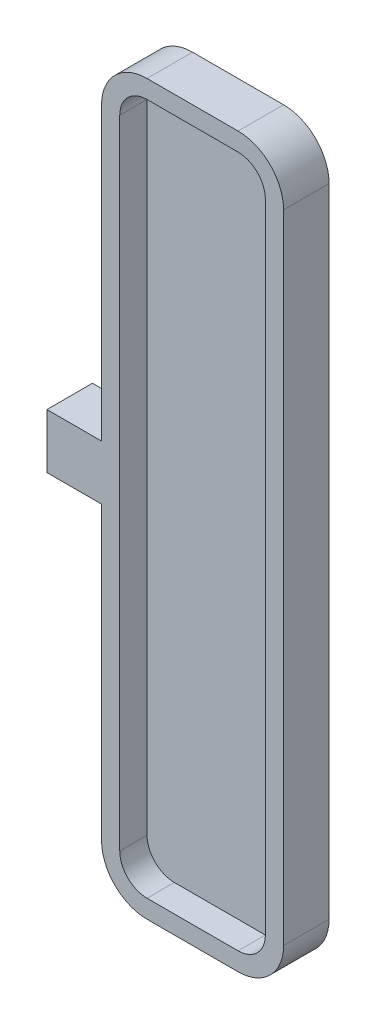
ISO-10303-21;
HEADER;
FILE_DESCRIPTION(('STEP AP214'),'2;1');
FILE_NAME('part.step','',(''),(''),'','','');
FILE_SCHEMA(('AUTOMOTIVE_DESIGN { 1 0 10303 214 1 1 1 1 }'));
ENDSEC;
DATA;
#1=APPLICATION_CONTEXT('core data for automotive mechanical design processes');
#2=APPLICATION_PROTOCOL_DEFINITION('international standard','automotive_design',2000,#1);
#3=PRODUCT_CONTEXT('',#1,'mechanical');
#4=PRODUCT('Part','Part','',(#3));
#5=PRODUCT_RELATED_PRODUCT_CATEGORY('part','',(#4));
#6=PRODUCT_DEFINITION_FORMATION('','',#4);
#7=PRODUCT_DEFINITION_CONTEXT('part definition',#1,'design');
#8=PRODUCT_DEFINITION('design','',#6,#7);
#9=PRODUCT_DEFINITION_SHAPE('','',#8);
#10=(LENGTH_UNIT() NAMED_UNIT(*) SI_UNIT(.MILLI.,.METRE.));
#11=(NAMED_UNIT(*) PLANE_ANGLE_UNIT() SI_UNIT($,.RADIAN.));
#12=(NAMED_UNIT(*) SI_UNIT($,.STERADIAN.) SOLID_ANGLE_UNIT());
#13=UNCERTAINTY_MEASURE_WITH_UNIT(LENGTH_MEASURE(1.E-05),#10,'distance_accuracy_value','');
#14=(GEOMETRIC_REPRESENTATION_CONTEXT(3) GLOBAL_UNCERTAINTY_ASSIGNED_CONTEXT((#13)) GLOBAL_UNIT_ASSIGNED_CONTEXT((#10,
#11,#12)) REPRESENTATION_CONTEXT('',''));
#15=CARTESIAN_POINT('',(0.,0.,0.));
#16=DIRECTION('',(0.,0.,1.));
#17=DIRECTION('',(1.,0.,0.));
#18=AXIS2_PLACEMENT_3D('',#15,#16,#17);
#19=CARTESIAN_POINT('',(-10.,-40.,5.));
#20=DIRECTION('',(1.,0.,0.));
#21=DIRECTION('',(0.,0.,-1.));
#22=AXIS2_PLACEMENT_3D('',#19,#20,#21);
#23=PLANE('',#22);
#24=DIRECTION('',(0.,0.,1.));
#25=VECTOR('',#24,1.);
#26=CARTESIAN_POINT('',(-10.,-3.,5.));
#27=LINE('',#26,#25);
#28=CARTESIAN_POINT('',(-10.,-3.,0.));
#29=VERTEX_POINT('',#28);
#30=CARTESIAN_POINT('',(-10.,-3.,5.));
#31=VERTEX_POINT('',#30);
#32=EDGE_CURVE('E396',#29,#31,#27,.T.);
#33=ORIENTED_EDGE('',*,*,#32,.F.);
#34=DIRECTION('',(0.,-1.,0.));
#35=VECTOR('',#34,1.);
#36=CARTESIAN_POINT('',(-10.,-40.,0.));
#37=LINE('',#36,#35);
#38=CARTESIAN_POINT('',(-10.,-35.,0.));
#39=VERTEX_POINT('',#38);
#40=EDGE_CURVE('E204',#29,#39,#37,.T.);
#41=ORIENTED_EDGE('',*,*,#40,.T.);
#42=DIRECTION('',(0.,0.,-1.));
#43=VECTOR('',#42,1.);
#44=CARTESIAN_POINT('',(-10.,-35.,5.));
#45=LINE('',#44,#43);
#46=CARTESIAN_POINT('',(-10.,-35.,5.));
#47=VERTEX_POINT('',#46);
#48=EDGE_CURVE('E349',#39,#47,#45,.F.);
#49=ORIENTED_EDGE('',*,*,#48,.T.);
#50=DIRECTION('',(0.,-1.,0.));
#51=VECTOR('',#50,1.);
#52=CARTESIAN_POINT('',(-10.,-40.,5.));
#53=LINE('',#52,#51);
#54=EDGE_CURVE('E55',#31,#47,#53,.T.);
#55=ORIENTED_EDGE('',*,*,#54,.F.);
#56=EDGE_LOOP('',(#33,#41,#49,#55));
#57=FACE_BOUND('',#56,.T.);
#58=ADVANCED_FACE('F39',(#57),#23,.F.);
#59=DIRECTION('',(0.,0.,-1.));
#60=VECTOR('',#59,1.);
#61=CARTESIAN_POINT('',(-10.,3.,5.));
#62=LINE('',#61,#60);
#63=CARTESIAN_POINT('',(-10.,3.,5.));
#64=VERTEX_POINT('',#63);
#65=CARTESIAN_POINT('',(-10.,3.,0.));
#66=VERTEX_POINT('',#65);
#67=EDGE_CURVE('E63',#64,#66,#62,.T.);
#68=ORIENTED_EDGE('',*,*,#67,.F.);
#69=CARTESIAN_POINT('',(-10.,35.,5.));
#70=VERTEX_POINT('',#69);
#71=EDGE_CURVE('E296',#70,#64,#53,.T.);
#72=ORIENTED_EDGE('',*,*,#71,.F.);
#73=DIRECTION('',(0.,0.,-1.));
#74=VECTOR('',#73,1.);
#75=CARTESIAN_POINT('',(-10.,35.,5.));
#76=LINE('',#75,#74);
#77=CARTESIAN_POINT('',(-10.,35.,0.));
#78=VERTEX_POINT('',#77);
#79=EDGE_CURVE('E345',#70,#78,#76,.T.);
#80=ORIENTED_EDGE('',*,*,#79,.T.);
#81=EDGE_CURVE('E312',#78,#66,#37,.T.);
#82=ORIENTED_EDGE('',*,*,#81,.T.);
#83=EDGE_LOOP('',(#68,#72,#80,#82));
#84=FACE_BOUND('',#83,.T.);
#85=ADVANCED_FACE('F384',(#84),#23,.F.);
#86=CARTESIAN_POINT('',(10.,-40.,5.));
#87=DIRECTION('',(0.,1.,0.));
#88=DIRECTION('',(0.,0.,1.));
#89=AXIS2_PLACEMENT_3D('',#86,#87,#88);
#90=PLANE('',#89);
#91=DIRECTION('',(1.,0.,0.));
#92=VECTOR('',#91,1.);
#93=CARTESIAN_POINT('',(10.,-40.,5.));
#94=LINE('',#93,#92);
#95=CARTESIAN_POINT('',(-5.,-40.,5.));
#96=VERTEX_POINT('',#95);
#97=CARTESIAN_POINT('',(5.,-40.,5.));
#98=VERTEX_POINT('',#97);
#99=EDGE_CURVE('E299',#96,#98,#94,.T.);
#100=ORIENTED_EDGE('',*,*,#99,.F.);
#101=DIRECTION('',(0.,0.,-1.));
#102=VECTOR('',#101,1.);
#103=CARTESIAN_POINT('',(-5.,-40.,5.));
#104=LINE('',#103,#102);
#105=CARTESIAN_POINT('',(-5.,-40.,0.));
#106=VERTEX_POINT('',#105);
#107=EDGE_CURVE('E329',#96,#106,#104,.T.);
#108=ORIENTED_EDGE('',*,*,#107,.T.);
#109=DIRECTION('',(1.,0.,0.));
#110=VECTOR('',#109,1.);
#111=CARTESIAN_POINT('',(10.,-40.,0.));
#112=LINE('',#111,#110);
#113=CARTESIAN_POINT('',(5.,-40.,0.));
#114=VERTEX_POINT('',#113);
#115=EDGE_CURVE('E315',#106,#114,#112,.T.);
#116=ORIENTED_EDGE('',*,*,#115,.T.);
#117=DIRECTION('',(0.,0.,-1.));
#118=VECTOR('',#117,1.);
#119=CARTESIAN_POINT('',(5.,-40.,5.));
#120=LINE('',#119,#118);
#121=EDGE_CURVE('E311',#114,#98,#120,.F.);
#122=ORIENTED_EDGE('',*,*,#121,.T.);
#123=EDGE_LOOP('',(#100,#108,#116,#122));
#124=FACE_BOUND('',#123,.T.);
#125=ADVANCED_FACE('F430',(#124),#90,.F.);
#126=CARTESIAN_POINT('',(10.,-40.,5.));
#127=DIRECTION('',(-1.,0.,0.));
#128=DIRECTION('',(0.,0.,1.));
#129=AXIS2_PLACEMENT_3D('',#126,#127,#128);
#130=PLANE('',#129);
#131=DIRECTION('',(0.,1.,0.));
#132=VECTOR('',#131,1.);
#133=CARTESIAN_POINT('',(10.,-40.,5.));
#134=LINE('',#133,#132);
#135=CARTESIAN_POINT('',(10.,-35.,5.));
#136=VERTEX_POINT('',#135);
#137=CARTESIAN_POINT('',(10.,35.,5.));
#138=VERTEX_POINT('',#137);
#139=EDGE_CURVE('E303',#136,#138,#134,.T.);
#140=ORIENTED_EDGE('',*,*,#139,.F.);
#141=DIRECTION('',(0.,0.,-1.));
#142=VECTOR('',#141,1.);
#143=CARTESIAN_POINT('',(10.,-35.,5.));
#144=LINE('',#143,#142);
#145=CARTESIAN_POINT('',(10.,-35.,0.));
#146=VERTEX_POINT('',#145);
#147=EDGE_CURVE('E367',#136,#146,#144,.T.);
#148=ORIENTED_EDGE('',*,*,#147,.T.);
#149=DIRECTION('',(0.,1.,0.));
#150=VECTOR('',#149,1.);
#151=CARTESIAN_POINT('',(10.,-40.,0.));
#152=LINE('',#151,#150);
#153=CARTESIAN_POINT('',(10.,35.,0.));
#154=VERTEX_POINT('',#153);
#155=EDGE_CURVE('E319',#146,#154,#152,.T.);
#156=ORIENTED_EDGE('',*,*,#155,.T.);
#157=DIRECTION('',(0.,0.,-1.));
#158=VECTOR('',#157,1.);
#159=CARTESIAN_POINT('',(10.,35.,5.));
#160=LINE('',#159,#158);
#161=EDGE_CURVE('E364',#154,#138,#160,.F.);
#162=ORIENTED_EDGE('',*,*,#161,.T.);
#163=EDGE_LOOP('',(#140,#148,#156,#162));
#164=FACE_BOUND('',#163,.T.);
#165=ADVANCED_FACE('F452',(#164),#130,.F.);
#166=CARTESIAN_POINT('',(10.,40.,5.));
#167=DIRECTION('',(0.,-1.,0.));
#168=DIRECTION('',(1.,0.,0.));
#169=AXIS2_PLACEMENT_3D('',#166,#167,#168);
#170=PLANE('',#169);
#171=DIRECTION('',(-1.,0.,0.));
#172=VECTOR('',#171,1.);
#173=CARTESIAN_POINT('',(10.,40.,5.));
#174=LINE('',#173,#172);
#175=CARTESIAN_POINT('',(5.,40.,5.));
#176=VERTEX_POINT('',#175);
#177=CARTESIAN_POINT('',(-5.,40.,5.));
#178=VERTEX_POINT('',#177);
#179=EDGE_CURVE('E307',#176,#178,#174,.T.);
#180=ORIENTED_EDGE('',*,*,#179,.F.);
#181=DIRECTION('',(0.,0.,-1.));
#182=VECTOR('',#181,1.);
#183=CARTESIAN_POINT('',(5.,40.,5.));
#184=LINE('',#183,#182);
#185=CARTESIAN_POINT('',(5.,40.,0.));
#186=VERTEX_POINT('',#185);
#187=EDGE_CURVE('E11',#176,#186,#184,.T.);
#188=ORIENTED_EDGE('',*,*,#187,.T.);
#189=DIRECTION('',(-1.,0.,0.));
#190=VECTOR('',#189,1.);
#191=CARTESIAN_POINT('',(10.,40.,0.));
#192=LINE('',#191,#190);
#193=CARTESIAN_POINT('',(-5.,40.,0.));
#194=VERTEX_POINT('',#193);
#195=EDGE_CURVE('E323',#186,#194,#192,.T.);
#196=ORIENTED_EDGE('',*,*,#195,.T.);
#197=DIRECTION('',(0.,0.,-1.));
#198=VECTOR('',#197,1.);
#199=CARTESIAN_POINT('',(-5.,40.,5.));
#200=LINE('',#199,#198);
#201=EDGE_CURVE('E48',#194,#178,#200,.F.);
#202=ORIENTED_EDGE('',*,*,#201,.T.);
#203=EDGE_LOOP('',(#180,#188,#196,#202));
#204=FACE_BOUND('',#203,.T.);
#205=ADVANCED_FACE('F374',(#204),#170,.F.);
#206=CARTESIAN_POINT('',(0.,0.,5.));
#207=DIRECTION('',(0.,0.,1.));
#208=DIRECTION('',(1.,0.,0.));
#209=AXIS2_PLACEMENT_3D('',#206,#207,#208);
#210=PLANE('',#209);
#211=DIRECTION('',(0.,-1.,0.));
#212=VECTOR('',#211,1.);
#213=CARTESIAN_POINT('',(-8.,-40.,5.));
#214=LINE('',#213,#212);
#215=CARTESIAN_POINT('',(-8.,35.,5.));
#216=VERTEX_POINT('',#215);
#217=CARTESIAN_POINT('',(-8.,-35.,5.));
#218=VERTEX_POINT('',#217);
#219=EDGE_CURVE('E242',#216,#218,#214,.T.);
#220=ORIENTED_EDGE('',*,*,#219,.F.);
#221=CARTESIAN_POINT('',(-5.,35.,5.));
#222=DIRECTION('',(0.,0.,1.));
#223=DIRECTION('',(1.,0.,0.));
#224=AXIS2_PLACEMENT_3D('',#221,#222,#223);
#225=CIRCLE('',#224,3.);
#226=CARTESIAN_POINT('',(-5.,38.,5.));
#227=VERTEX_POINT('',#226);
#228=EDGE_CURVE('E220',#227,#216,#225,.T.);
#229=ORIENTED_EDGE('',*,*,#228,.F.);
#230=DIRECTION('',(-1.,0.,0.));
#231=VECTOR('',#230,1.);
#232=CARTESIAN_POINT('',(10.,38.,5.));
#233=LINE('',#232,#231);
#234=CARTESIAN_POINT('',(5.,38.,5.));
#235=VERTEX_POINT('',#234);
#236=EDGE_CURVE('E256',#235,#227,#233,.T.);
#237=ORIENTED_EDGE('',*,*,#236,.F.);
#238=CARTESIAN_POINT('',(5.,35.,5.));
#239=DIRECTION('',(0.,0.,1.));
#240=DIRECTION('',(1.,0.,0.));
#241=AXIS2_PLACEMENT_3D('',#238,#239,#240);
#242=CIRCLE('',#241,3.);
#243=CARTESIAN_POINT('',(8.,35.,5.));
#244=VERTEX_POINT('',#243);
#245=EDGE_CURVE('E286',#244,#235,#242,.T.);
#246=ORIENTED_EDGE('',*,*,#245,.F.);
#247=DIRECTION('',(0.,1.,0.));
#248=VECTOR('',#247,1.);
#249=CARTESIAN_POINT('',(8.,-40.,5.));
#250=LINE('',#249,#248);
#251=CARTESIAN_POINT('',(8.,-35.,5.));
#252=VERTEX_POINT('',#251);
#253=EDGE_CURVE('E283',#252,#244,#250,.T.);
#254=ORIENTED_EDGE('',*,*,#253,.F.);
#255=CARTESIAN_POINT('',(5.,-35.,5.));
#256=DIRECTION('',(0.,0.,1.));
#257=DIRECTION('',(1.,0.,0.));
#258=AXIS2_PLACEMENT_3D('',#255,#256,#257);
#259=CIRCLE('',#258,3.);
#260=CARTESIAN_POINT('',(5.,-38.,5.));
#261=VERTEX_POINT('',#260);
#262=EDGE_CURVE('E279',#261,#252,#259,.T.);
#263=ORIENTED_EDGE('',*,*,#262,.F.);
#264=DIRECTION('',(1.,0.,0.));
#265=VECTOR('',#264,1.);
#266=CARTESIAN_POINT('',(10.,-38.,5.));
#267=LINE('',#266,#265);
#268=CARTESIAN_POINT('',(-5.,-38.,5.));
#269=VERTEX_POINT('',#268);
#270=EDGE_CURVE('E276',#269,#261,#267,.T.);
#271=ORIENTED_EDGE('',*,*,#270,.F.);
#272=CARTESIAN_POINT('',(-5.,-35.,5.));
#273=DIRECTION('',(0.,0.,1.));
#274=DIRECTION('',(1.,0.,0.));
#275=AXIS2_PLACEMENT_3D('',#272,#273,#274);
#276=CIRCLE('',#275,3.);
#277=EDGE_CURVE('E265',#218,#269,#276,.T.);
#278=ORIENTED_EDGE('',*,*,#277,.F.);
#279=EDGE_LOOP('',(#220,#229,#237,#246,#254,#263,#271,#278));
#280=FACE_BOUND('',#279,.T.);
#281=ORIENTED_EDGE('',*,*,#71,.T.);
#282=DIRECTION('',(1.,0.,0.));
#283=VECTOR('',#282,1.);
#284=CARTESIAN_POINT('',(-16.,3.,5.));
#285=LINE('',#284,#283);
#286=CARTESIAN_POINT('',(-16.,3.,5.));
#287=VERTEX_POINT('',#286);
#288=EDGE_CURVE('E213',#287,#64,#285,.T.);
#289=ORIENTED_EDGE('',*,*,#288,.F.);
#290=DIRECTION('',(0.,1.,0.));
#291=VECTOR('',#290,1.);
#292=CARTESIAN_POINT('',(-16.,3.,5.));
#293=LINE('',#292,#291);
#294=CARTESIAN_POINT('',(-16.,-3.,5.));
#295=VERTEX_POINT('',#294);
#296=EDGE_CURVE('E189',#295,#287,#293,.T.);
#297=ORIENTED_EDGE('',*,*,#296,.F.);
#298=DIRECTION('',(1.,0.,0.));
#299=VECTOR('',#298,1.);
#300=CARTESIAN_POINT('',(-16.,-3.,5.));
#301=LINE('',#300,#299);
#302=EDGE_CURVE('E185',#295,#31,#301,.T.);
#303=ORIENTED_EDGE('',*,*,#302,.T.);
#304=ORIENTED_EDGE('',*,*,#54,.T.);
#305=CARTESIAN_POINT('',(-5.,-35.,5.));
#306=DIRECTION('',(0.,0.,1.));
#307=DIRECTION('',(1.,0.,0.));
#308=AXIS2_PLACEMENT_3D('',#305,#306,#307);
#309=CIRCLE('',#308,5.);
#310=EDGE_CURVE('E361',#47,#96,#309,.T.);
#311=ORIENTED_EDGE('',*,*,#310,.T.);
#312=ORIENTED_EDGE('',*,*,#99,.T.);
#313=CARTESIAN_POINT('',(5.,-35.,5.));
#314=DIRECTION('',(0.,0.,1.));
#315=DIRECTION('',(1.,0.,0.));
#316=AXIS2_PLACEMENT_3D('',#313,#314,#315);
#317=CIRCLE('',#316,5.);
#318=EDGE_CURVE('E358',#98,#136,#317,.T.);
#319=ORIENTED_EDGE('',*,*,#318,.T.);
#320=ORIENTED_EDGE('',*,*,#139,.T.);
#321=CARTESIAN_POINT('',(5.,35.,5.));
#322=DIRECTION('',(0.,0.,1.));
#323=DIRECTION('',(1.,0.,0.));
#324=AXIS2_PLACEMENT_3D('',#321,#322,#323);
#325=CIRCLE('',#324,5.);
#326=EDGE_CURVE('E355',#138,#176,#325,.T.);
#327=ORIENTED_EDGE('',*,*,#326,.T.);
#328=ORIENTED_EDGE('',*,*,#179,.T.);
#329=CARTESIAN_POINT('',(-5.,35.,5.));
#330=DIRECTION('',(0.,0.,1.));
#331=DIRECTION('',(1.,0.,0.));
#332=AXIS2_PLACEMENT_3D('',#329,#330,#331);
#333=CIRCLE('',#332,5.);
#334=EDGE_CURVE('E352',#178,#70,#333,.T.);
#335=ORIENTED_EDGE('',*,*,#334,.T.);
#336=EDGE_LOOP('',(#281,#289,#297,#303,#304,#311,#312,#319,#320,#327,#328,#335));
#337=FACE_BOUND('',#336,.T.);
#338=ADVANCED_FACE('F380',(#280,#337),#210,.T.);
#339=CARTESIAN_POINT('',(0.,0.,0.));
#340=DIRECTION('',(0.,0.,1.));
#341=DIRECTION('',(1.,0.,0.));
#342=AXIS2_PLACEMENT_3D('',#339,#340,#341);
#343=PLANE('',#342);
#344=ORIENTED_EDGE('',*,*,#115,.F.);
#345=CARTESIAN_POINT('',(-5.,-35.,0.));
#346=DIRECTION('',(0.,0.,1.));
#347=DIRECTION('',(1.,0.,0.));
#348=AXIS2_PLACEMENT_3D('',#345,#346,#347);
#349=CIRCLE('',#348,5.);
#350=EDGE_CURVE('E342',#106,#39,#349,.F.);
#351=ORIENTED_EDGE('',*,*,#350,.T.);
#352=ORIENTED_EDGE('',*,*,#40,.F.);
#353=DIRECTION('',(1.,0.,0.));
#354=VECTOR('',#353,1.);
#355=CARTESIAN_POINT('',(-16.,-3.,0.));
#356=LINE('',#355,#354);
#357=CARTESIAN_POINT('',(-16.,-3.,0.));
#358=VERTEX_POINT('',#357);
#359=EDGE_CURVE('E183',#358,#29,#356,.T.);
#360=ORIENTED_EDGE('',*,*,#359,.F.);
#361=DIRECTION('',(0.,-1.,0.));
#362=VECTOR('',#361,1.);
#363=CARTESIAN_POINT('',(-16.,3.,0.));
#364=LINE('',#363,#362);
#365=CARTESIAN_POINT('',(-16.,3.,0.));
#366=VERTEX_POINT('',#365);
#367=EDGE_CURVE('E190',#366,#358,#364,.T.);
#368=ORIENTED_EDGE('',*,*,#367,.F.);
#369=DIRECTION('',(1.,0.,0.));
#370=VECTOR('',#369,1.);
#371=CARTESIAN_POINT('',(-16.,3.,0.));
#372=LINE('',#371,#370);
#373=EDGE_CURVE('E385',#366,#66,#372,.T.);
#374=ORIENTED_EDGE('',*,*,#373,.T.);
#375=ORIENTED_EDGE('',*,*,#81,.F.);
#376=CARTESIAN_POINT('',(-5.,35.,0.));
#377=DIRECTION('',(0.,0.,1.));
#378=DIRECTION('',(1.,0.,0.));
#379=AXIS2_PLACEMENT_3D('',#376,#377,#378);
#380=CIRCLE('',#379,5.);
#381=EDGE_CURVE('E333',#78,#194,#380,.F.);
#382=ORIENTED_EDGE('',*,*,#381,.T.);
#383=ORIENTED_EDGE('',*,*,#195,.F.);
#384=CARTESIAN_POINT('',(5.,35.,0.));
#385=DIRECTION('',(0.,0.,1.));
#386=DIRECTION('',(1.,0.,0.));
#387=AXIS2_PLACEMENT_3D('',#384,#385,#386);
#388=CIRCLE('',#387,5.);
#389=EDGE_CURVE('E336',#186,#154,#388,.F.);
#390=ORIENTED_EDGE('',*,*,#389,.T.);
#391=ORIENTED_EDGE('',*,*,#155,.F.);
#392=CARTESIAN_POINT('',(5.,-35.,0.));
#393=DIRECTION('',(0.,0.,1.));
#394=DIRECTION('',(1.,0.,0.));
#395=AXIS2_PLACEMENT_3D('',#392,#393,#394);
#396=CIRCLE('',#395,5.);
#397=EDGE_CURVE('E339',#146,#114,#396,.F.);
#398=ORIENTED_EDGE('',*,*,#397,.T.);
#399=EDGE_LOOP('',(#344,#351,#352,#360,#368,#374,#375,#382,#383,#390,#391,#398));
#400=FACE_BOUND('',#399,.T.);
#401=ADVANCED_FACE('F202',(#400),#343,.F.);
#402=CARTESIAN_POINT('',(-5.,-35.,5.));
#403=DIRECTION('',(0.,0.,-1.));
#404=DIRECTION('',(-1.,0.,0.));
#405=AXIS2_PLACEMENT_3D('',#402,#403,#404);
#406=CYLINDRICAL_SURFACE('',#405,5.);
#407=ORIENTED_EDGE('',*,*,#310,.F.);
#408=ORIENTED_EDGE('',*,*,#48,.F.);
#409=ORIENTED_EDGE('',*,*,#350,.F.);
#410=ORIENTED_EDGE('',*,*,#107,.F.);
#411=EDGE_LOOP('',(#407,#408,#409,#410));
#412=FACE_BOUND('',#411,.T.);
#413=ADVANCED_FACE('F434',(#412),#406,.T.);
#414=CARTESIAN_POINT('',(5.,-35.,5.));
#415=DIRECTION('',(0.,0.,-1.));
#416=DIRECTION('',(-1.,0.,0.));
#417=AXIS2_PLACEMENT_3D('',#414,#415,#416);
#418=CYLINDRICAL_SURFACE('',#417,5.);
#419=ORIENTED_EDGE('',*,*,#318,.F.);
#420=ORIENTED_EDGE('',*,*,#121,.F.);
#421=ORIENTED_EDGE('',*,*,#397,.F.);
#422=ORIENTED_EDGE('',*,*,#147,.F.);
#423=EDGE_LOOP('',(#419,#420,#421,#422));
#424=FACE_BOUND('',#423,.T.);
#425=ADVANCED_FACE('F437',(#424),#418,.T.);
#426=CARTESIAN_POINT('',(5.,35.,5.));
#427=DIRECTION('',(0.,0.,-1.));
#428=DIRECTION('',(-1.,0.,0.));
#429=AXIS2_PLACEMENT_3D('',#426,#427,#428);
#430=CYLINDRICAL_SURFACE('',#429,5.);
#431=ORIENTED_EDGE('',*,*,#326,.F.);
#432=ORIENTED_EDGE('',*,*,#161,.F.);
#433=ORIENTED_EDGE('',*,*,#389,.F.);
#434=ORIENTED_EDGE('',*,*,#187,.F.);
#435=EDGE_LOOP('',(#431,#432,#433,#434));
#436=FACE_BOUND('',#435,.T.);
#437=ADVANCED_FACE('F440',(#436),#430,.T.);
#438=CARTESIAN_POINT('',(-5.,35.,5.));
#439=DIRECTION('',(0.,0.,-1.));
#440=DIRECTION('',(-1.,0.,0.));
#441=AXIS2_PLACEMENT_3D('',#438,#439,#440);
#442=CYLINDRICAL_SURFACE('',#441,5.);
#443=ORIENTED_EDGE('',*,*,#334,.F.);
#444=ORIENTED_EDGE('',*,*,#201,.F.);
#445=ORIENTED_EDGE('',*,*,#381,.F.);
#446=ORIENTED_EDGE('',*,*,#79,.F.);
#447=EDGE_LOOP('',(#443,#444,#445,#446));
#448=FACE_BOUND('',#447,.T.);
#449=ADVANCED_FACE('F41',(#448),#442,.T.);
#450=CARTESIAN_POINT('',(-8.,-40.,5.));
#451=DIRECTION('',(1.,0.,0.));
#452=DIRECTION('',(0.,0.,-1.));
#453=AXIS2_PLACEMENT_3D('',#450,#451,#452);
#454=PLANE('',#453);
#455=DIRECTION('',(0.,-1.,0.));
#456=VECTOR('',#455,1.);
#457=CARTESIAN_POINT('',(-8.,-40.,2.));
#458=LINE('',#457,#456);
#459=CARTESIAN_POINT('',(-8.,35.,2.));
#460=VERTEX_POINT('',#459);
#461=CARTESIAN_POINT('',(-8.,-35.,2.));
#462=VERTEX_POINT('',#461);
#463=EDGE_CURVE('E206',#460,#462,#458,.T.);
#464=ORIENTED_EDGE('',*,*,#463,.F.);
#465=DIRECTION('',(0.,0.,-1.));
#466=VECTOR('',#465,1.);
#467=CARTESIAN_POINT('',(-8.,35.,5.));
#468=LINE('',#467,#466);
#469=EDGE_CURVE('E221',#216,#460,#468,.T.);
#470=ORIENTED_EDGE('',*,*,#469,.F.);
#471=ORIENTED_EDGE('',*,*,#219,.T.);
#472=DIRECTION('',(0.,0.,-1.));
#473=VECTOR('',#472,1.);
#474=CARTESIAN_POINT('',(-8.,-35.,5.));
#475=LINE('',#474,#473);
#476=EDGE_CURVE('E217',#462,#218,#475,.F.);
#477=ORIENTED_EDGE('',*,*,#476,.F.);
#478=EDGE_LOOP('',(#464,#470,#471,#477));
#479=FACE_BOUND('',#478,.T.);
#480=ADVANCED_FACE('F447',(#479),#454,.T.);
#481=CARTESIAN_POINT('',(10.,-38.,5.));
#482=DIRECTION('',(0.,1.,0.));
#483=DIRECTION('',(0.,0.,1.));
#484=AXIS2_PLACEMENT_3D('',#481,#482,#483);
#485=PLANE('',#484);
#486=ORIENTED_EDGE('',*,*,#270,.T.);
#487=DIRECTION('',(0.,0.,1.));
#488=VECTOR('',#487,1.);
#489=CARTESIAN_POINT('',(5.,-38.,5.));
#490=LINE('',#489,#488);
#491=CARTESIAN_POINT('',(5.,-38.,2.));
#492=VERTEX_POINT('',#491);
#493=EDGE_CURVE('E253',#492,#261,#490,.T.);
#494=ORIENTED_EDGE('',*,*,#493,.F.);
#495=DIRECTION('',(1.,0.,0.));
#496=VECTOR('',#495,1.);
#497=CARTESIAN_POINT('',(10.,-38.,2.));
#498=LINE('',#497,#496);
#499=CARTESIAN_POINT('',(-5.,-38.,2.));
#500=VERTEX_POINT('',#499);
#501=EDGE_CURVE('E211',#500,#492,#498,.T.);
#502=ORIENTED_EDGE('',*,*,#501,.F.);
#503=DIRECTION('',(0.,0.,1.));
#504=VECTOR('',#503,1.);
#505=CARTESIAN_POINT('',(-5.,-38.,5.));
#506=LINE('',#505,#504);
#507=EDGE_CURVE('E237',#269,#500,#506,.F.);
#508=ORIENTED_EDGE('',*,*,#507,.F.);
#509=EDGE_LOOP('',(#486,#494,#502,#508));
#510=FACE_BOUND('',#509,.T.);
#511=ADVANCED_FACE('F505',(#510),#485,.T.);
#512=CARTESIAN_POINT('',(8.,-40.,5.));
#513=DIRECTION('',(-1.,0.,0.));
#514=DIRECTION('',(0.,0.,1.));
#515=AXIS2_PLACEMENT_3D('',#512,#513,#514);
#516=PLANE('',#515);
#517=ORIENTED_EDGE('',*,*,#253,.T.);
#518=DIRECTION('',(0.,0.,1.));
#519=VECTOR('',#518,1.);
#520=CARTESIAN_POINT('',(8.,35.,5.));
#521=LINE('',#520,#519);
#522=CARTESIAN_POINT('',(8.,35.,2.));
#523=VERTEX_POINT('',#522);
#524=EDGE_CURVE('E262',#523,#244,#521,.T.);
#525=ORIENTED_EDGE('',*,*,#524,.F.);
#526=DIRECTION('',(0.,1.,0.));
#527=VECTOR('',#526,1.);
#528=CARTESIAN_POINT('',(8.,-40.,2.));
#529=LINE('',#528,#527);
#530=CARTESIAN_POINT('',(8.,-35.,2.));
#531=VERTEX_POINT('',#530);
#532=EDGE_CURVE('E229',#531,#523,#529,.T.);
#533=ORIENTED_EDGE('',*,*,#532,.F.);
#534=DIRECTION('',(0.,0.,1.));
#535=VECTOR('',#534,1.);
#536=CARTESIAN_POINT('',(8.,-35.,5.));
#537=LINE('',#536,#535);
#538=EDGE_CURVE('E257',#252,#531,#537,.F.);
#539=ORIENTED_EDGE('',*,*,#538,.F.);
#540=EDGE_LOOP('',(#517,#525,#533,#539));
#541=FACE_BOUND('',#540,.T.);
#542=ADVANCED_FACE('F501',(#541),#516,.T.);
#543=CARTESIAN_POINT('',(10.,38.,5.));
#544=DIRECTION('',(0.,-1.,0.));
#545=DIRECTION('',(1.,0.,0.));
#546=AXIS2_PLACEMENT_3D('',#543,#544,#545);
#547=PLANE('',#546);
#548=ORIENTED_EDGE('',*,*,#236,.T.);
#549=DIRECTION('',(0.,0.,1.));
#550=VECTOR('',#549,1.);
#551=CARTESIAN_POINT('',(-5.,38.,5.));
#552=LINE('',#551,#550);
#553=CARTESIAN_POINT('',(-5.,38.,2.));
#554=VERTEX_POINT('',#553);
#555=EDGE_CURVE('E261',#554,#227,#552,.T.);
#556=ORIENTED_EDGE('',*,*,#555,.F.);
#557=DIRECTION('',(-1.,0.,0.));
#558=VECTOR('',#557,1.);
#559=CARTESIAN_POINT('',(10.,38.,2.));
#560=LINE('',#559,#558);
#561=CARTESIAN_POINT('',(5.,38.,2.));
#562=VERTEX_POINT('',#561);
#563=EDGE_CURVE('E238',#562,#554,#560,.T.);
#564=ORIENTED_EDGE('',*,*,#563,.F.);
#565=DIRECTION('',(0.,0.,1.));
#566=VECTOR('',#565,1.);
#567=CARTESIAN_POINT('',(5.,38.,5.));
#568=LINE('',#567,#566);
#569=EDGE_CURVE('E266',#235,#562,#568,.F.);
#570=ORIENTED_EDGE('',*,*,#569,.F.);
#571=EDGE_LOOP('',(#548,#556,#564,#570));
#572=FACE_BOUND('',#571,.T.);
#573=ADVANCED_FACE('F497',(#572),#547,.T.);
#574=CARTESIAN_POINT('',(0.,0.,2.));
#575=DIRECTION('',(0.,0.,1.));
#576=DIRECTION('',(1.,0.,0.));
#577=AXIS2_PLACEMENT_3D('',#574,#575,#576);
#578=PLANE('',#577);
#579=ORIENTED_EDGE('',*,*,#501,.T.);
#580=CARTESIAN_POINT('',(5.,-35.,2.));
#581=DIRECTION('',(0.,0.,1.));
#582=DIRECTION('',(1.,0.,0.));
#583=AXIS2_PLACEMENT_3D('',#580,#581,#582);
#584=CIRCLE('',#583,3.);
#585=EDGE_CURVE('E232',#531,#492,#584,.F.);
#586=ORIENTED_EDGE('',*,*,#585,.F.);
#587=ORIENTED_EDGE('',*,*,#532,.T.);
#588=CARTESIAN_POINT('',(5.,35.,2.));
#589=DIRECTION('',(0.,0.,1.));
#590=DIRECTION('',(1.,0.,0.));
#591=AXIS2_PLACEMENT_3D('',#588,#589,#590);
#592=CIRCLE('',#591,3.);
#593=EDGE_CURVE('E236',#562,#523,#592,.F.);
#594=ORIENTED_EDGE('',*,*,#593,.F.);
#595=ORIENTED_EDGE('',*,*,#563,.T.);
#596=CARTESIAN_POINT('',(-5.,35.,2.));
#597=DIRECTION('',(0.,0.,1.));
#598=DIRECTION('',(1.,0.,0.));
#599=AXIS2_PLACEMENT_3D('',#596,#597,#598);
#600=CIRCLE('',#599,3.);
#601=EDGE_CURVE('E233',#460,#554,#600,.F.);
#602=ORIENTED_EDGE('',*,*,#601,.F.);
#603=ORIENTED_EDGE('',*,*,#463,.T.);
#604=CARTESIAN_POINT('',(-5.,-35.,2.));
#605=DIRECTION('',(0.,0.,1.));
#606=DIRECTION('',(1.,0.,0.));
#607=AXIS2_PLACEMENT_3D('',#604,#605,#606);
#608=CIRCLE('',#607,3.);
#609=EDGE_CURVE('E225',#500,#462,#608,.F.);
#610=ORIENTED_EDGE('',*,*,#609,.F.);
#611=EDGE_LOOP('',(#579,#586,#587,#594,#595,#602,#603,#610));
#612=FACE_BOUND('',#611,.T.);
#613=ADVANCED_FACE('F493',(#612),#578,.T.);
#614=CARTESIAN_POINT('',(-5.,-35.,5.));
#615=DIRECTION('',(0.,0.,-1.));
#616=DIRECTION('',(-1.,0.,0.));
#617=AXIS2_PLACEMENT_3D('',#614,#615,#616);
#618=CYLINDRICAL_SURFACE('',#617,3.);
#619=ORIENTED_EDGE('',*,*,#277,.T.);
#620=ORIENTED_EDGE('',*,*,#507,.T.);
#621=ORIENTED_EDGE('',*,*,#609,.T.);
#622=ORIENTED_EDGE('',*,*,#476,.T.);
#623=EDGE_LOOP('',(#619,#620,#621,#622));
#624=FACE_BOUND('',#623,.T.);
#625=ADVANCED_FACE('F489',(#624),#618,.F.);
#626=CARTESIAN_POINT('',(5.,-35.,5.));
#627=DIRECTION('',(0.,0.,-1.));
#628=DIRECTION('',(-1.,0.,0.));
#629=AXIS2_PLACEMENT_3D('',#626,#627,#628);
#630=CYLINDRICAL_SURFACE('',#629,3.);
#631=ORIENTED_EDGE('',*,*,#262,.T.);
#632=ORIENTED_EDGE('',*,*,#538,.T.);
#633=ORIENTED_EDGE('',*,*,#585,.T.);
#634=ORIENTED_EDGE('',*,*,#493,.T.);
#635=EDGE_LOOP('',(#631,#632,#633,#634));
#636=FACE_BOUND('',#635,.T.);
#637=ADVANCED_FACE('F485',(#636),#630,.F.);
#638=CARTESIAN_POINT('',(5.,35.,5.));
#639=DIRECTION('',(0.,0.,-1.));
#640=DIRECTION('',(-1.,0.,0.));
#641=AXIS2_PLACEMENT_3D('',#638,#639,#640);
#642=CYLINDRICAL_SURFACE('',#641,3.);
#643=ORIENTED_EDGE('',*,*,#245,.T.);
#644=ORIENTED_EDGE('',*,*,#569,.T.);
#645=ORIENTED_EDGE('',*,*,#593,.T.);
#646=ORIENTED_EDGE('',*,*,#524,.T.);
#647=EDGE_LOOP('',(#643,#644,#645,#646));
#648=FACE_BOUND('',#647,.T.);
#649=ADVANCED_FACE('F481',(#648),#642,.F.);
#650=CARTESIAN_POINT('',(-5.,35.,5.));
#651=DIRECTION('',(0.,0.,-1.));
#652=DIRECTION('',(-1.,0.,0.));
#653=AXIS2_PLACEMENT_3D('',#650,#651,#652);
#654=CYLINDRICAL_SURFACE('',#653,3.);
#655=ORIENTED_EDGE('',*,*,#228,.T.);
#656=ORIENTED_EDGE('',*,*,#469,.T.);
#657=ORIENTED_EDGE('',*,*,#601,.T.);
#658=ORIENTED_EDGE('',*,*,#555,.T.);
#659=EDGE_LOOP('',(#655,#656,#657,#658));
#660=FACE_BOUND('',#659,.T.);
#661=ADVANCED_FACE('F478',(#660),#654,.F.);
#662=CARTESIAN_POINT('',(-16.,-3.,5.));
#663=DIRECTION('',(0.,1.,0.));
#664=DIRECTION('',(0.,0.,1.));
#665=AXIS2_PLACEMENT_3D('',#662,#663,#664);
#666=PLANE('',#665);
#667=ORIENTED_EDGE('',*,*,#32,.T.);
#668=ORIENTED_EDGE('',*,*,#302,.F.);
#669=DIRECTION('',(0.,0.,1.));
#670=VECTOR('',#669,1.);
#671=CARTESIAN_POINT('',(-16.,-3.,5.));
#672=LINE('',#671,#670);
#673=EDGE_CURVE('E179',#358,#295,#672,.T.);
#674=ORIENTED_EDGE('',*,*,#673,.F.);
#675=ORIENTED_EDGE('',*,*,#359,.T.);
#676=EDGE_LOOP('',(#667,#668,#674,#675));
#677=FACE_BOUND('',#676,.T.);
#678=ADVANCED_FACE('F181',(#677),#666,.F.);
#679=CARTESIAN_POINT('',(-16.,3.,5.));
#680=DIRECTION('',(0.,-1.,0.));
#681=DIRECTION('',(0.,0.,-1.));
#682=AXIS2_PLACEMENT_3D('',#679,#680,#681);
#683=PLANE('',#682);
#684=ORIENTED_EDGE('',*,*,#67,.T.);
#685=ORIENTED_EDGE('',*,*,#373,.F.);
#686=DIRECTION('',(0.,0.,-1.));
#687=VECTOR('',#686,1.);
#688=CARTESIAN_POINT('',(-16.,3.,5.));
#689=LINE('',#688,#687);
#690=EDGE_CURVE('E195',#287,#366,#689,.T.);
#691=ORIENTED_EDGE('',*,*,#690,.F.);
#692=ORIENTED_EDGE('',*,*,#288,.T.);
#693=EDGE_LOOP('',(#684,#685,#691,#692));
#694=FACE_BOUND('',#693,.T.);
#695=ADVANCED_FACE('F419',(#694),#683,.F.);
#696=CARTESIAN_POINT('',(-16.,0.,0.));
#697=DIRECTION('',(1.,0.,0.));
#698=DIRECTION('',(0.,0.,-1.));
#699=AXIS2_PLACEMENT_3D('',#696,#697,#698);
#700=PLANE('',#699);
#701=CARTESIAN_POINT('',(-16.,0.,2.5));
#702=DIRECTION('',(-1.,0.,0.));
#703=DIRECTION('',(0.,0.,1.));
#704=AXIS2_PLACEMENT_3D('',#701,#702,#703);
#705=CIRCLE('',#704,1.425);
#706=CARTESIAN_POINT('',(-16.,0.,3.925));
#707=VERTEX_POINT('',#706);
#708=EDGE_CURVE('E402',#707,#707,#705,.T.);
#709=ORIENTED_EDGE('',*,*,#708,.F.);
#710=EDGE_LOOP('',(#709));
#711=FACE_BOUND('',#710,.T.);
#712=ORIENTED_EDGE('',*,*,#367,.T.);
#713=ORIENTED_EDGE('',*,*,#673,.T.);
#714=ORIENTED_EDGE('',*,*,#296,.T.);
#715=ORIENTED_EDGE('',*,*,#690,.T.);
#716=EDGE_LOOP('',(#712,#713,#714,#715));
#717=FACE_BOUND('',#716,.T.);
#718=ADVANCED_FACE('F193',(#711,#717),#700,.F.);
#719=CARTESIAN_POINT('',(-12.,0.,2.5));
#720=DIRECTION('',(-1.,0.,0.));
#721=DIRECTION('',(0.,0.,1.));
#722=AXIS2_PLACEMENT_3D('',#719,#720,#721);
#723=CYLINDRICAL_SURFACE('',#722,1.425);
#724=CARTESIAN_POINT('',(-12.,0.,2.5));
#725=DIRECTION('',(-1.,0.,0.));
#726=DIRECTION('',(0.,0.,1.));
#727=AXIS2_PLACEMENT_3D('',#724,#725,#726);
#728=CIRCLE('',#727,1.425);
#729=CARTESIAN_POINT('',(-12.,0.,3.925));
#730=VERTEX_POINT('',#729);
#731=EDGE_CURVE('E398',#730,#730,#728,.T.);
#732=ORIENTED_EDGE('',*,*,#731,.F.);
#733=EDGE_LOOP('',(#732));
#734=FACE_BOUND('',#733,.T.);
#735=ORIENTED_EDGE('',*,*,#708,.T.);
#736=EDGE_LOOP('',(#735));
#737=FACE_BOUND('',#736,.T.);
#738=ADVANCED_FACE('F412',(#734,#737),#723,.F.);
#739=CARTESIAN_POINT('',(-12.,0.,2.5));
#740=DIRECTION('',(-1.,0.,0.));
#741=DIRECTION('',(0.,0.,1.));
#742=AXIS2_PLACEMENT_3D('',#739,#740,#741);
#743=PLANE('',#742);
#744=ORIENTED_EDGE('',*,*,#731,.T.);
#745=EDGE_LOOP('',(#744));
#746=FACE_BOUND('',#745,.T.);
#747=ADVANCED_FACE('F410',(#746),#743,.T.);
#748=CLOSED_SHELL('',(#58,#85,#125,#165,#205,#338,#401,#413,#425,#437,#449,#480,#511,#542,#573,
#613,#625,#637,#649,#661,#678,#695,#718,#738,#747));
#749=MANIFOLD_SOLID_BREP('B2',#748);
#750=ADVANCED_BREP_SHAPE_REPRESENTATION('',(#18,#749),#14);
#751=SHAPE_DEFINITION_REPRESENTATION(#9,#750);
ENDSEC;
END-ISO-10303-21;
